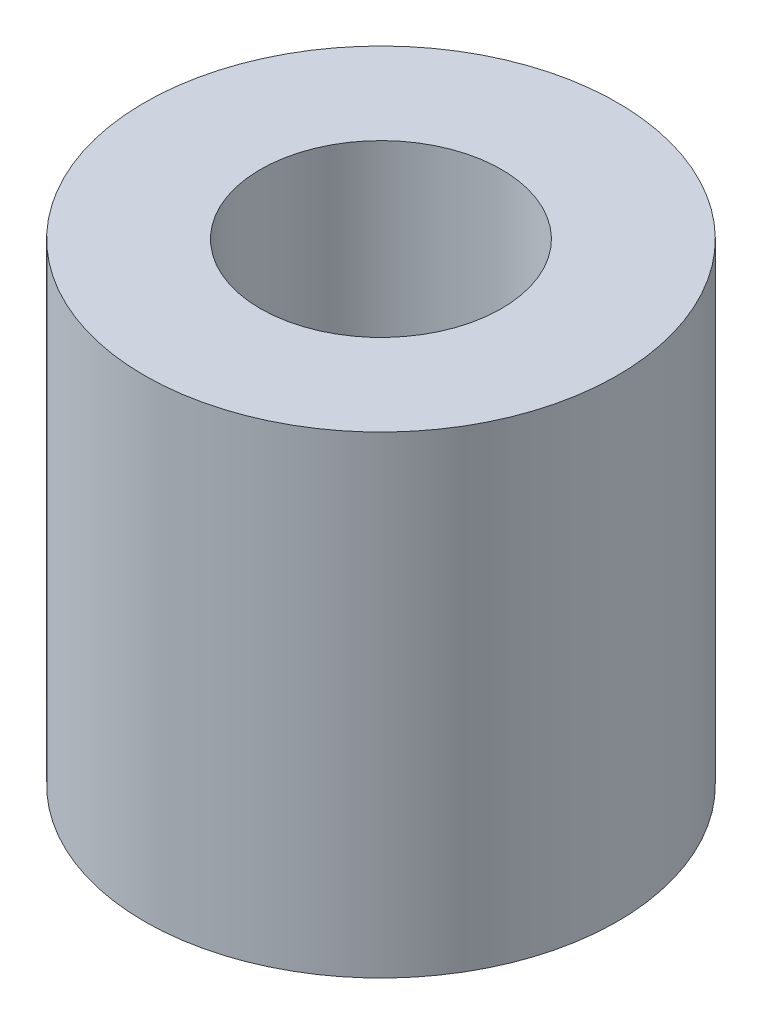
ISO-10303-21;
HEADER;
FILE_DESCRIPTION(('STEP AP214'),'2;1');
FILE_NAME('part.step','',(''),(''),'','','');
FILE_SCHEMA(('AUTOMOTIVE_DESIGN { 1 0 10303 214 1 1 1 1 }'));
ENDSEC;
DATA;
#1=APPLICATION_CONTEXT('core data for automotive mechanical design processes');
#2=APPLICATION_PROTOCOL_DEFINITION('international standard','automotive_design',2000,#1);
#3=PRODUCT_CONTEXT('',#1,'mechanical');
#4=PRODUCT('Part','Part','',(#3));
#5=PRODUCT_RELATED_PRODUCT_CATEGORY('part','',(#4));
#6=PRODUCT_DEFINITION_FORMATION('','',#4);
#7=PRODUCT_DEFINITION_CONTEXT('part definition',#1,'design');
#8=PRODUCT_DEFINITION('design','',#6,#7);
#9=PRODUCT_DEFINITION_SHAPE('','',#8);
#10=(LENGTH_UNIT() NAMED_UNIT(*) SI_UNIT(.MILLI.,.METRE.));
#11=(NAMED_UNIT(*) PLANE_ANGLE_UNIT() SI_UNIT($,.RADIAN.));
#12=(NAMED_UNIT(*) SI_UNIT($,.STERADIAN.) SOLID_ANGLE_UNIT());
#13=UNCERTAINTY_MEASURE_WITH_UNIT(LENGTH_MEASURE(1.E-05),#10,'distance_accuracy_value','');
#14=(GEOMETRIC_REPRESENTATION_CONTEXT(3) GLOBAL_UNCERTAINTY_ASSIGNED_CONTEXT((#13)) GLOBAL_UNIT_ASSIGNED_CONTEXT((#10,
#11,#12)) REPRESENTATION_CONTEXT('',''));
#15=CARTESIAN_POINT('',(0.,0.,0.));
#16=DIRECTION('',(0.,0.,1.));
#17=DIRECTION('',(1.,0.,0.));
#18=AXIS2_PLACEMENT_3D('',#15,#16,#17);
#19=CARTESIAN_POINT('',(0.,10.,0.));
#20=DIRECTION('',(0.,1.,0.));
#21=DIRECTION('',(0.,0.,1.));
#22=AXIS2_PLACEMENT_3D('',#19,#20,#21);
#23=PLANE('',#22);
#24=CARTESIAN_POINT('',(0.,10.,0.));
#25=DIRECTION('',(0.,1.,0.));
#26=DIRECTION('',(0.,0.,1.));
#27=AXIS2_PLACEMENT_3D('',#24,#25,#26);
#28=CIRCLE('',#27,5.);
#29=CARTESIAN_POINT('',(0.,10.,5.));
#30=VERTEX_POINT('',#29);
#31=EDGE_CURVE('E10',#30,#30,#28,.T.);
#32=ORIENTED_EDGE('',*,*,#31,.T.);
#33=EDGE_LOOP('',(#32));
#34=FACE_BOUND('',#33,.T.);
#35=CARTESIAN_POINT('',(0.,10.,0.));
#36=DIRECTION('',(0.,1.,0.));
#37=DIRECTION('',(0.,0.,1.));
#38=AXIS2_PLACEMENT_3D('',#35,#36,#37);
#39=CIRCLE('',#38,2.55);
#40=CARTESIAN_POINT('',(0.,10.,2.55));
#41=VERTEX_POINT('',#40);
#42=EDGE_CURVE('E42',#41,#41,#39,.T.);
#43=ORIENTED_EDGE('',*,*,#42,.F.);
#44=EDGE_LOOP('',(#43));
#45=FACE_BOUND('',#44,.T.);
#46=ADVANCED_FACE('F31',(#34,#45),#23,.T.);
#47=CARTESIAN_POINT('',(0.,0.,0.));
#48=DIRECTION('',(0.,1.,0.));
#49=DIRECTION('',(0.,0.,1.));
#50=AXIS2_PLACEMENT_3D('',#47,#48,#49);
#51=PLANE('',#50);
#52=CARTESIAN_POINT('',(0.,0.,0.));
#53=DIRECTION('',(0.,1.,0.));
#54=DIRECTION('',(0.,0.,1.));
#55=AXIS2_PLACEMENT_3D('',#52,#53,#54);
#56=CIRCLE('',#55,5.);
#57=CARTESIAN_POINT('',(0.,0.,5.));
#58=VERTEX_POINT('',#57);
#59=EDGE_CURVE('E35',#58,#58,#56,.T.);
#60=ORIENTED_EDGE('',*,*,#59,.F.);
#61=EDGE_LOOP('',(#60));
#62=FACE_BOUND('',#61,.T.);
#63=CARTESIAN_POINT('',(0.,0.,0.));
#64=DIRECTION('',(0.,1.,0.));
#65=DIRECTION('',(0.,0.,1.));
#66=AXIS2_PLACEMENT_3D('',#63,#64,#65);
#67=CIRCLE('',#66,2.55);
#68=CARTESIAN_POINT('',(0.,0.,2.55));
#69=VERTEX_POINT('',#68);
#70=EDGE_CURVE('E44',#69,#69,#67,.T.);
#71=ORIENTED_EDGE('',*,*,#70,.T.);
#72=EDGE_LOOP('',(#71));
#73=FACE_BOUND('',#72,.T.);
#74=ADVANCED_FACE('F54',(#62,#73),#51,.F.);
#75=CARTESIAN_POINT('',(0.,10.,0.));
#76=DIRECTION('',(0.,-1.,0.));
#77=DIRECTION('',(0.,0.,-1.));
#78=AXIS2_PLACEMENT_3D('',#75,#76,#77);
#79=CYLINDRICAL_SURFACE('',#78,5.);
#80=ORIENTED_EDGE('',*,*,#31,.F.);
#81=EDGE_LOOP('',(#80));
#82=FACE_BOUND('',#81,.T.);
#83=ORIENTED_EDGE('',*,*,#59,.T.);
#84=EDGE_LOOP('',(#83));
#85=FACE_BOUND('',#84,.T.);
#86=ADVANCED_FACE('F33',(#82,#85),#79,.T.);
#87=CARTESIAN_POINT('',(0.,10.,0.));
#88=DIRECTION('',(0.,-1.,0.));
#89=DIRECTION('',(0.,0.,-1.));
#90=AXIS2_PLACEMENT_3D('',#87,#88,#89);
#91=CYLINDRICAL_SURFACE('',#90,2.55);
#92=ORIENTED_EDGE('',*,*,#42,.T.);
#93=EDGE_LOOP('',(#92));
#94=FACE_BOUND('',#93,.T.);
#95=ORIENTED_EDGE('',*,*,#70,.F.);
#96=EDGE_LOOP('',(#95));
#97=FACE_BOUND('',#96,.T.);
#98=ADVANCED_FACE('F50',(#94,#97),#91,.F.);
#99=CLOSED_SHELL('',(#46,#74,#86,#98));
#100=MANIFOLD_SOLID_BREP('B2',#99);
#101=ADVANCED_BREP_SHAPE_REPRESENTATION('',(#18,#100),#14);
#102=SHAPE_DEFINITION_REPRESENTATION(#9,#101);
ENDSEC;
END-ISO-10303-21;
